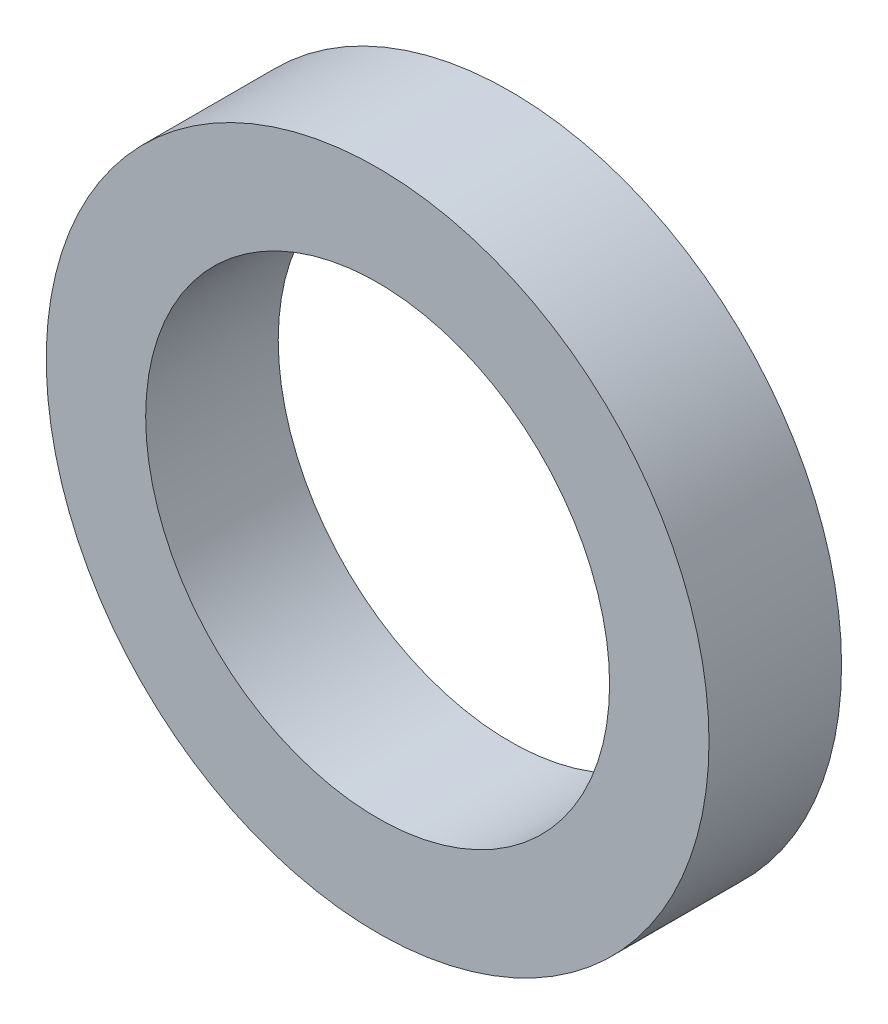
ISO-10303-21;
HEADER;
FILE_DESCRIPTION(('STEP AP214'),'2;1');
FILE_NAME('part.step','',(''),(''),'','','');
FILE_SCHEMA(('AUTOMOTIVE_DESIGN { 1 0 10303 214 1 1 1 1 }'));
ENDSEC;
DATA;
#1=APPLICATION_CONTEXT('core data for automotive mechanical design processes');
#2=APPLICATION_PROTOCOL_DEFINITION('international standard','automotive_design',2000,#1);
#3=PRODUCT_CONTEXT('',#1,'mechanical');
#4=PRODUCT('Part','Part','',(#3));
#5=PRODUCT_RELATED_PRODUCT_CATEGORY('part','',(#4));
#6=PRODUCT_DEFINITION_FORMATION('','',#4);
#7=PRODUCT_DEFINITION_CONTEXT('part definition',#1,'design');
#8=PRODUCT_DEFINITION('design','',#6,#7);
#9=PRODUCT_DEFINITION_SHAPE('','',#8);
#10=(LENGTH_UNIT() NAMED_UNIT(*) SI_UNIT(.MILLI.,.METRE.));
#11=(NAMED_UNIT(*) PLANE_ANGLE_UNIT() SI_UNIT($,.RADIAN.));
#12=(NAMED_UNIT(*) SI_UNIT($,.STERADIAN.) SOLID_ANGLE_UNIT());
#13=UNCERTAINTY_MEASURE_WITH_UNIT(LENGTH_MEASURE(1.E-05),#10,'distance_accuracy_value','');
#14=(GEOMETRIC_REPRESENTATION_CONTEXT(3) GLOBAL_UNCERTAINTY_ASSIGNED_CONTEXT((#13)) GLOBAL_UNIT_ASSIGNED_CONTEXT((#10,
#11,#12)) REPRESENTATION_CONTEXT('',''));
#15=CARTESIAN_POINT('',(0.,0.,0.));
#16=DIRECTION('',(0.,0.,1.));
#17=DIRECTION('',(1.,0.,0.));
#18=AXIS2_PLACEMENT_3D('',#15,#16,#17);
#19=CARTESIAN_POINT('',(0.,0.,14.));
#20=DIRECTION('',(0.,0.,-1.));
#21=DIRECTION('',(-1.,0.,0.));
#22=AXIS2_PLACEMENT_3D('',#19,#20,#21);
#23=CYLINDRICAL_SURFACE('',#22,35.);
#24=CARTESIAN_POINT('',(0.,0.,14.));
#25=DIRECTION('',(0.,0.,1.));
#26=DIRECTION('',(1.,0.,0.));
#27=AXIS2_PLACEMENT_3D('',#24,#25,#26);
#28=CIRCLE('',#27,35.);
#29=CARTESIAN_POINT('',(35.,0.,14.));
#30=VERTEX_POINT('',#29);
#31=EDGE_CURVE('E10',#30,#30,#28,.T.);
#32=ORIENTED_EDGE('',*,*,#31,.F.);
#33=EDGE_LOOP('',(#32));
#34=FACE_BOUND('',#33,.T.);
#35=CARTESIAN_POINT('',(0.,0.,0.));
#36=DIRECTION('',(0.,0.,1.));
#37=DIRECTION('',(1.,0.,0.));
#38=AXIS2_PLACEMENT_3D('',#35,#36,#37);
#39=CIRCLE('',#38,35.);
#40=CARTESIAN_POINT('',(35.,0.,0.));
#41=VERTEX_POINT('',#40);
#42=EDGE_CURVE('E42',#41,#41,#39,.T.);
#43=ORIENTED_EDGE('',*,*,#42,.T.);
#44=EDGE_LOOP('',(#43));
#45=FACE_BOUND('',#44,.T.);
#46=ADVANCED_FACE('F39',(#34,#45),#23,.T.);
#47=CARTESIAN_POINT('',(0.,0.,14.));
#48=DIRECTION('',(0.,0.,1.));
#49=DIRECTION('',(1.,0.,0.));
#50=AXIS2_PLACEMENT_3D('',#47,#48,#49);
#51=PLANE('',#50);
#52=CARTESIAN_POINT('',(0.,0.,14.));
#53=DIRECTION('',(0.,0.,1.));
#54=DIRECTION('',(1.,0.,0.));
#55=AXIS2_PLACEMENT_3D('',#52,#53,#54);
#56=CIRCLE('',#55,24.5);
#57=CARTESIAN_POINT('',(24.5,0.,14.));
#58=VERTEX_POINT('',#57);
#59=EDGE_CURVE('E51',#58,#58,#56,.T.);
#60=ORIENTED_EDGE('',*,*,#59,.F.);
#61=EDGE_LOOP('',(#60));
#62=FACE_BOUND('',#61,.T.);
#63=ORIENTED_EDGE('',*,*,#31,.T.);
#64=EDGE_LOOP('',(#63));
#65=FACE_BOUND('',#64,.T.);
#66=ADVANCED_FACE('F64',(#62,#65),#51,.T.);
#67=CARTESIAN_POINT('',(0.,0.,0.));
#68=DIRECTION('',(0.,0.,1.));
#69=DIRECTION('',(1.,0.,0.));
#70=AXIS2_PLACEMENT_3D('',#67,#68,#69);
#71=PLANE('',#70);
#72=CARTESIAN_POINT('',(0.,0.,0.));
#73=DIRECTION('',(0.,0.,1.));
#74=DIRECTION('',(1.,0.,0.));
#75=AXIS2_PLACEMENT_3D('',#72,#73,#74);
#76=CIRCLE('',#75,24.5);
#77=CARTESIAN_POINT('',(24.5,0.,0.));
#78=VERTEX_POINT('',#77);
#79=EDGE_CURVE('E53',#78,#78,#76,.T.);
#80=ORIENTED_EDGE('',*,*,#79,.T.);
#81=EDGE_LOOP('',(#80));
#82=FACE_BOUND('',#81,.T.);
#83=ORIENTED_EDGE('',*,*,#42,.F.);
#84=EDGE_LOOP('',(#83));
#85=FACE_BOUND('',#84,.T.);
#86=ADVANCED_FACE('F66',(#82,#85),#71,.F.);
#87=CARTESIAN_POINT('',(0.,0.,14.));
#88=DIRECTION('',(0.,0.,-1.));
#89=DIRECTION('',(-1.,0.,0.));
#90=AXIS2_PLACEMENT_3D('',#87,#88,#89);
#91=CYLINDRICAL_SURFACE('',#90,24.5);
#92=ORIENTED_EDGE('',*,*,#59,.T.);
#93=EDGE_LOOP('',(#92));
#94=FACE_BOUND('',#93,.T.);
#95=ORIENTED_EDGE('',*,*,#79,.F.);
#96=EDGE_LOOP('',(#95));
#97=FACE_BOUND('',#96,.T.);
#98=ADVANCED_FACE('F61',(#94,#97),#91,.F.);
#99=CLOSED_SHELL('',(#46,#66,#86,#98));
#100=MANIFOLD_SOLID_BREP('B2',#99);
#101=ADVANCED_BREP_SHAPE_REPRESENTATION('',(#18,#100),#14);
#102=SHAPE_DEFINITION_REPRESENTATION(#9,#101);
ENDSEC;
END-ISO-10303-21;
